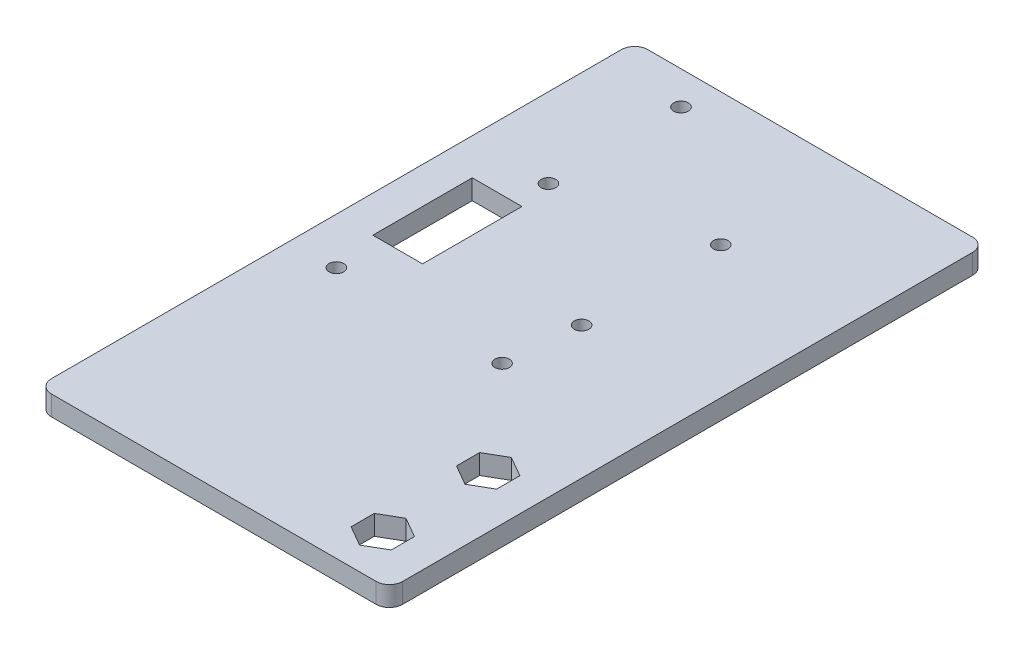
ISO-10303-21;
HEADER;
FILE_DESCRIPTION(('STEP AP214'),'2;1');
FILE_NAME('part.step','',(''),(''),'','','');
FILE_SCHEMA(('AUTOMOTIVE_DESIGN { 1 0 10303 214 1 1 1 1 }'));
ENDSEC;
DATA;
#1=APPLICATION_CONTEXT('core data for automotive mechanical design processes');
#2=APPLICATION_PROTOCOL_DEFINITION('international standard','automotive_design',2000,#1);
#3=PRODUCT_CONTEXT('',#1,'mechanical');
#4=PRODUCT('Part','Part','',(#3));
#5=PRODUCT_RELATED_PRODUCT_CATEGORY('part','',(#4));
#6=PRODUCT_DEFINITION_FORMATION('','',#4);
#7=PRODUCT_DEFINITION_CONTEXT('part definition',#1,'design');
#8=PRODUCT_DEFINITION('design','',#6,#7);
#9=PRODUCT_DEFINITION_SHAPE('','',#8);
#10=(LENGTH_UNIT() NAMED_UNIT(*) SI_UNIT(.MILLI.,.METRE.));
#11=(NAMED_UNIT(*) PLANE_ANGLE_UNIT() SI_UNIT($,.RADIAN.));
#12=(NAMED_UNIT(*) SI_UNIT($,.STERADIAN.) SOLID_ANGLE_UNIT());
#13=UNCERTAINTY_MEASURE_WITH_UNIT(LENGTH_MEASURE(1.E-05),#10,'distance_accuracy_value','');
#14=(GEOMETRIC_REPRESENTATION_CONTEXT(3) GLOBAL_UNCERTAINTY_ASSIGNED_CONTEXT((#13)) GLOBAL_UNIT_ASSIGNED_CONTEXT((#10,
#11,#12)) REPRESENTATION_CONTEXT('',''));
#15=CARTESIAN_POINT('',(0.,0.,0.));
#16=DIRECTION('',(0.,0.,1.));
#17=DIRECTION('',(1.,0.,0.));
#18=AXIS2_PLACEMENT_3D('',#15,#16,#17);
#19=CARTESIAN_POINT('',(51.,3.,-88.));
#20=DIRECTION('',(0.,-1.,0.));
#21=DIRECTION('',(0.,0.,-1.));
#22=AXIS2_PLACEMENT_3D('',#19,#20,#21);
#23=CYLINDRICAL_SURFACE('',#22,2.);
#24=CARTESIAN_POINT('',(51.,0.,-88.));
#25=DIRECTION('',(0.,1.,0.));
#26=DIRECTION('',(0.,0.,-1.));
#27=AXIS2_PLACEMENT_3D('',#24,#25,#26);
#28=CIRCLE('',#27,2.);
#29=CARTESIAN_POINT('',(53.,0.,-88.));
#30=VERTEX_POINT('',#29);
#31=CARTESIAN_POINT('',(51.,0.,-90.));
#32=VERTEX_POINT('',#31);
#33=EDGE_CURVE('E314',#30,#32,#28,.T.);
#34=ORIENTED_EDGE('',*,*,#33,.T.);
#35=DIRECTION('',(0.,-1.,0.));
#36=VECTOR('',#35,1.);
#37=CARTESIAN_POINT('',(51.,3.,-90.));
#38=LINE('',#37,#36);
#39=CARTESIAN_POINT('',(51.,3.,-90.));
#40=VERTEX_POINT('',#39);
#41=EDGE_CURVE('E11',#40,#32,#38,.T.);
#42=ORIENTED_EDGE('',*,*,#41,.F.);
#43=CARTESIAN_POINT('',(51.,3.,-88.));
#44=DIRECTION('',(0.,1.,0.));
#45=DIRECTION('',(0.,0.,-1.));
#46=AXIS2_PLACEMENT_3D('',#43,#44,#45);
#47=CIRCLE('',#46,2.);
#48=CARTESIAN_POINT('',(53.,3.,-88.));
#49=VERTEX_POINT('',#48);
#50=EDGE_CURVE('E355',#49,#40,#47,.T.);
#51=ORIENTED_EDGE('',*,*,#50,.F.);
#52=DIRECTION('',(0.,-1.,0.));
#53=VECTOR('',#52,1.);
#54=CARTESIAN_POINT('',(53.,3.,-88.));
#55=LINE('',#54,#53);
#56=EDGE_CURVE('E373',#49,#30,#55,.T.);
#57=ORIENTED_EDGE('',*,*,#56,.T.);
#58=EDGE_LOOP('',(#34,#42,#51,#57));
#59=FACE_BOUND('',#58,.T.);
#60=ADVANCED_FACE('F33',(#59),#23,.T.);
#61=CARTESIAN_POINT('',(2.,3.,-90.));
#62=DIRECTION('',(0.,0.,1.));
#63=DIRECTION('',(1.,0.,0.));
#64=AXIS2_PLACEMENT_3D('',#61,#62,#63);
#65=PLANE('',#64);
#66=DIRECTION('',(-1.,0.,0.));
#67=VECTOR('',#66,1.);
#68=CARTESIAN_POINT('',(2.,0.,-90.));
#69=LINE('',#68,#67);
#70=CARTESIAN_POINT('',(2.,0.,-90.));
#71=VERTEX_POINT('',#70);
#72=EDGE_CURVE('E376',#32,#71,#69,.T.);
#73=ORIENTED_EDGE('',*,*,#72,.T.);
#74=DIRECTION('',(0.,-1.,0.));
#75=VECTOR('',#74,1.);
#76=CARTESIAN_POINT('',(2.,3.,-90.));
#77=LINE('',#76,#75);
#78=CARTESIAN_POINT('',(2.,3.,-90.));
#79=VERTEX_POINT('',#78);
#80=EDGE_CURVE('E40',#79,#71,#77,.T.);
#81=ORIENTED_EDGE('',*,*,#80,.F.);
#82=DIRECTION('',(-1.,0.,0.));
#83=VECTOR('',#82,1.);
#84=CARTESIAN_POINT('',(2.,3.,-90.));
#85=LINE('',#84,#83);
#86=EDGE_CURVE('E358',#40,#79,#85,.T.);
#87=ORIENTED_EDGE('',*,*,#86,.F.);
#88=ORIENTED_EDGE('',*,*,#41,.T.);
#89=EDGE_LOOP('',(#73,#81,#87,#88));
#90=FACE_BOUND('',#89,.T.);
#91=ADVANCED_FACE('F432',(#90),#65,.F.);
#92=CARTESIAN_POINT('',(2.,3.,-88.));
#93=DIRECTION('',(0.,-1.,0.));
#94=DIRECTION('',(0.,0.,-1.));
#95=AXIS2_PLACEMENT_3D('',#92,#93,#94);
#96=CYLINDRICAL_SURFACE('',#95,2.);
#97=CARTESIAN_POINT('',(2.,0.,-88.));
#98=DIRECTION('',(0.,1.,0.));
#99=DIRECTION('',(0.,0.,1.));
#100=AXIS2_PLACEMENT_3D('',#97,#98,#99);
#101=CIRCLE('',#100,2.);
#102=CARTESIAN_POINT('',(0.,0.,-88.));
#103=VERTEX_POINT('',#102);
#104=EDGE_CURVE('E378',#71,#103,#101,.T.);
#105=ORIENTED_EDGE('',*,*,#104,.T.);
#106=DIRECTION('',(0.,-1.,0.));
#107=VECTOR('',#106,1.);
#108=CARTESIAN_POINT('',(0.,3.,-88.));
#109=LINE('',#108,#107);
#110=CARTESIAN_POINT('',(0.,3.,-88.));
#111=VERTEX_POINT('',#110);
#112=EDGE_CURVE('E403',#111,#103,#109,.T.);
#113=ORIENTED_EDGE('',*,*,#112,.F.);
#114=CARTESIAN_POINT('',(2.,3.,-88.));
#115=DIRECTION('',(0.,1.,0.));
#116=DIRECTION('',(0.,0.,1.));
#117=AXIS2_PLACEMENT_3D('',#114,#115,#116);
#118=CIRCLE('',#117,2.);
#119=EDGE_CURVE('E361',#79,#111,#118,.T.);
#120=ORIENTED_EDGE('',*,*,#119,.F.);
#121=ORIENTED_EDGE('',*,*,#80,.T.);
#122=EDGE_LOOP('',(#105,#113,#120,#121));
#123=FACE_BOUND('',#122,.T.);
#124=ADVANCED_FACE('F410',(#123),#96,.T.);
#125=CARTESIAN_POINT('',(0.,3.,-88.));
#126=DIRECTION('',(1.,0.,0.));
#127=DIRECTION('',(0.,0.,-1.));
#128=AXIS2_PLACEMENT_3D('',#125,#126,#127);
#129=PLANE('',#128);
#130=DIRECTION('',(0.,0.,1.));
#131=VECTOR('',#130,1.);
#132=CARTESIAN_POINT('',(0.,0.,-88.));
#133=LINE('',#132,#131);
#134=CARTESIAN_POINT('',(0.,0.,-2.));
#135=VERTEX_POINT('',#134);
#136=EDGE_CURVE('E380',#103,#135,#133,.T.);
#137=ORIENTED_EDGE('',*,*,#136,.T.);
#138=DIRECTION('',(0.,-1.,0.));
#139=VECTOR('',#138,1.);
#140=CARTESIAN_POINT('',(0.,3.,-2.));
#141=LINE('',#140,#139);
#142=CARTESIAN_POINT('',(0.,3.,-2.));
#143=VERTEX_POINT('',#142);
#144=EDGE_CURVE('E400',#143,#135,#141,.T.);
#145=ORIENTED_EDGE('',*,*,#144,.F.);
#146=DIRECTION('',(0.,0.,1.));
#147=VECTOR('',#146,1.);
#148=CARTESIAN_POINT('',(0.,3.,-88.));
#149=LINE('',#148,#147);
#150=EDGE_CURVE('E363',#111,#143,#149,.T.);
#151=ORIENTED_EDGE('',*,*,#150,.F.);
#152=ORIENTED_EDGE('',*,*,#112,.T.);
#153=EDGE_LOOP('',(#137,#145,#151,#152));
#154=FACE_BOUND('',#153,.T.);
#155=ADVANCED_FACE('F420',(#154),#129,.F.);
#156=CARTESIAN_POINT('',(2.00000000000002,3.,-2.));
#157=DIRECTION('',(0.,-1.,0.));
#158=DIRECTION('',(0.,0.,-1.));
#159=AXIS2_PLACEMENT_3D('',#156,#157,#158);
#160=CYLINDRICAL_SURFACE('',#159,2.);
#161=CARTESIAN_POINT('',(2.00000000000002,0.,-2.));
#162=DIRECTION('',(0.,1.,0.));
#163=DIRECTION('',(0.,0.,1.));
#164=AXIS2_PLACEMENT_3D('',#161,#162,#163);
#165=CIRCLE('',#164,2.);
#166=CARTESIAN_POINT('',(2.00000000000002,0.,0.));
#167=VERTEX_POINT('',#166);
#168=EDGE_CURVE('E382',#135,#167,#165,.T.);
#169=ORIENTED_EDGE('',*,*,#168,.T.);
#170=DIRECTION('',(0.,-1.,0.));
#171=VECTOR('',#170,1.);
#172=CARTESIAN_POINT('',(2.00000000000002,3.,0.));
#173=LINE('',#172,#171);
#174=CARTESIAN_POINT('',(2.00000000000002,3.,0.));
#175=VERTEX_POINT('',#174);
#176=EDGE_CURVE('E397',#175,#167,#173,.T.);
#177=ORIENTED_EDGE('',*,*,#176,.F.);
#178=CARTESIAN_POINT('',(2.00000000000002,3.,-2.));
#179=DIRECTION('',(0.,1.,0.));
#180=DIRECTION('',(0.,0.,1.));
#181=AXIS2_PLACEMENT_3D('',#178,#179,#180);
#182=CIRCLE('',#181,2.);
#183=EDGE_CURVE('E365',#143,#175,#182,.T.);
#184=ORIENTED_EDGE('',*,*,#183,.F.);
#185=ORIENTED_EDGE('',*,*,#144,.T.);
#186=EDGE_LOOP('',(#169,#177,#184,#185));
#187=FACE_BOUND('',#186,.T.);
#188=ADVANCED_FACE('F424',(#187),#160,.T.);
#189=CARTESIAN_POINT('',(2.00000000000002,3.,0.));
#190=DIRECTION('',(0.,0.,-1.));
#191=DIRECTION('',(-1.,0.,0.));
#192=AXIS2_PLACEMENT_3D('',#189,#190,#191);
#193=PLANE('',#192);
#194=DIRECTION('',(1.,0.,0.));
#195=VECTOR('',#194,1.);
#196=CARTESIAN_POINT('',(2.00000000000002,0.,0.));
#197=LINE('',#196,#195);
#198=CARTESIAN_POINT('',(51.,0.,0.));
#199=VERTEX_POINT('',#198);
#200=EDGE_CURVE('E384',#167,#199,#197,.T.);
#201=ORIENTED_EDGE('',*,*,#200,.T.);
#202=DIRECTION('',(0.,-1.,0.));
#203=VECTOR('',#202,1.);
#204=CARTESIAN_POINT('',(51.,3.,0.));
#205=LINE('',#204,#203);
#206=CARTESIAN_POINT('',(51.,3.,0.));
#207=VERTEX_POINT('',#206);
#208=EDGE_CURVE('E394',#207,#199,#205,.T.);
#209=ORIENTED_EDGE('',*,*,#208,.F.);
#210=DIRECTION('',(1.,0.,0.));
#211=VECTOR('',#210,1.);
#212=CARTESIAN_POINT('',(2.00000000000002,3.,0.));
#213=LINE('',#212,#211);
#214=EDGE_CURVE('E367',#175,#207,#213,.T.);
#215=ORIENTED_EDGE('',*,*,#214,.F.);
#216=ORIENTED_EDGE('',*,*,#176,.T.);
#217=EDGE_LOOP('',(#201,#209,#215,#216));
#218=FACE_BOUND('',#217,.T.);
#219=ADVANCED_FACE('F445',(#218),#193,.F.);
#220=CARTESIAN_POINT('',(51.,3.,-2.));
#221=DIRECTION('',(0.,-1.,0.));
#222=DIRECTION('',(0.,0.,-1.));
#223=AXIS2_PLACEMENT_3D('',#220,#221,#222);
#224=CYLINDRICAL_SURFACE('',#223,2.);
#225=CARTESIAN_POINT('',(51.,0.,-2.));
#226=DIRECTION('',(0.,1.,0.));
#227=DIRECTION('',(0.,0.,1.));
#228=AXIS2_PLACEMENT_3D('',#225,#226,#227);
#229=CIRCLE('',#228,2.);
#230=CARTESIAN_POINT('',(53.,0.,-2.));
#231=VERTEX_POINT('',#230);
#232=EDGE_CURVE('E386',#199,#231,#229,.T.);
#233=ORIENTED_EDGE('',*,*,#232,.T.);
#234=DIRECTION('',(0.,-1.,0.));
#235=VECTOR('',#234,1.);
#236=CARTESIAN_POINT('',(53.,3.,-2.));
#237=LINE('',#236,#235);
#238=CARTESIAN_POINT('',(53.,3.,-2.));
#239=VERTEX_POINT('',#238);
#240=EDGE_CURVE('E391',#239,#231,#237,.T.);
#241=ORIENTED_EDGE('',*,*,#240,.F.);
#242=CARTESIAN_POINT('',(51.,3.,-2.));
#243=DIRECTION('',(0.,1.,0.));
#244=DIRECTION('',(0.,0.,1.));
#245=AXIS2_PLACEMENT_3D('',#242,#243,#244);
#246=CIRCLE('',#245,2.);
#247=EDGE_CURVE('E369',#207,#239,#246,.T.);
#248=ORIENTED_EDGE('',*,*,#247,.F.);
#249=ORIENTED_EDGE('',*,*,#208,.T.);
#250=EDGE_LOOP('',(#233,#241,#248,#249));
#251=FACE_BOUND('',#250,.T.);
#252=ADVANCED_FACE('F443',(#251),#224,.T.);
#253=CARTESIAN_POINT('',(53.,3.,-88.));
#254=DIRECTION('',(-1.,0.,0.));
#255=DIRECTION('',(0.,0.,1.));
#256=AXIS2_PLACEMENT_3D('',#253,#254,#255);
#257=PLANE('',#256);
#258=DIRECTION('',(0.,0.,-1.));
#259=VECTOR('',#258,1.);
#260=CARTESIAN_POINT('',(53.,0.,-88.));
#261=LINE('',#260,#259);
#262=EDGE_CURVE('E359',#231,#30,#261,.T.);
#263=ORIENTED_EDGE('',*,*,#262,.T.);
#264=ORIENTED_EDGE('',*,*,#56,.F.);
#265=DIRECTION('',(0.,0.,-1.));
#266=VECTOR('',#265,1.);
#267=CARTESIAN_POINT('',(53.,3.,-88.));
#268=LINE('',#267,#266);
#269=EDGE_CURVE('E371',#239,#49,#268,.T.);
#270=ORIENTED_EDGE('',*,*,#269,.F.);
#271=ORIENTED_EDGE('',*,*,#240,.T.);
#272=EDGE_LOOP('',(#263,#264,#270,#271));
#273=FACE_BOUND('',#272,.T.);
#274=ADVANCED_FACE('F438',(#273),#257,.F.);
#275=CARTESIAN_POINT('',(51.,3.,-88.));
#276=DIRECTION('',(0.,-1.,0.));
#277=DIRECTION('',(0.,0.,-1.));
#278=AXIS2_PLACEMENT_3D('',#275,#276,#277);
#279=PLANE('',#278);
#280=CARTESIAN_POINT('',(7.,3.,-38.));
#281=DIRECTION('',(0.,1.,0.));
#282=DIRECTION('',(0.,0.,1.));
#283=AXIS2_PLACEMENT_3D('',#280,#281,#282);
#284=CIRCLE('',#283,1.1);
#285=CARTESIAN_POINT('',(7.,3.,-36.9));
#286=VERTEX_POINT('',#285);
#287=EDGE_CURVE('E732',#286,#286,#284,.T.);
#288=ORIENTED_EDGE('',*,*,#287,.F.);
#289=EDGE_LOOP('',(#288));
#290=FACE_BOUND('',#289,.T.);
#291=CARTESIAN_POINT('',(32.,3.,-38.));
#292=DIRECTION('',(0.,1.,0.));
#293=DIRECTION('',(0.,0.,1.));
#294=AXIS2_PLACEMENT_3D('',#291,#292,#293);
#295=CIRCLE('',#294,1.1);
#296=CARTESIAN_POINT('',(32.,3.,-36.9));
#297=VERTEX_POINT('',#296);
#298=EDGE_CURVE('E221',#297,#297,#295,.T.);
#299=ORIENTED_EDGE('',*,*,#298,.F.);
#300=EDGE_LOOP('',(#299));
#301=FACE_BOUND('',#300,.T.);
#302=DIRECTION('',(0.,0.,1.));
#303=VECTOR('',#302,1.);
#304=CARTESIAN_POINT('',(41.968911086742,3.,-8.74999999999999));
#305=LINE('',#304,#303);
#306=CARTESIAN_POINT('',(41.968911086742,3.,-8.74999999999999));
#307=VERTEX_POINT('',#306);
#308=CARTESIAN_POINT('',(41.968911086742,3.,-5.25));
#309=VERTEX_POINT('',#308);
#310=EDGE_CURVE('E232',#307,#309,#305,.T.);
#311=ORIENTED_EDGE('',*,*,#310,.F.);
#312=DIRECTION('',(-0.866025403784438,0.,0.500000000000001));
#313=VECTOR('',#312,1.);
#314=CARTESIAN_POINT('',(44.9999999999875,3.,-10.5));
#315=LINE('',#314,#313);
#316=CARTESIAN_POINT('',(44.9999999999875,3.,-10.5));
#317=VERTEX_POINT('',#316);
#318=EDGE_CURVE('E47',#317,#307,#315,.T.);
#319=ORIENTED_EDGE('',*,*,#318,.F.);
#320=DIRECTION('',(-0.866025403784438,0.,-0.500000000000001));
#321=VECTOR('',#320,1.);
#322=CARTESIAN_POINT('',(48.031088913233,3.,-8.75));
#323=LINE('',#322,#321);
#324=CARTESIAN_POINT('',(48.031088913233,3.,-8.75));
#325=VERTEX_POINT('',#324);
#326=EDGE_CURVE('E215',#325,#317,#323,.T.);
#327=ORIENTED_EDGE('',*,*,#326,.F.);
#328=DIRECTION('',(0.,0.,-1.));
#329=VECTOR('',#328,1.);
#330=CARTESIAN_POINT('',(48.031088913233,3.,-5.25));
#331=LINE('',#330,#329);
#332=CARTESIAN_POINT('',(48.031088913233,3.,-5.25));
#333=VERTEX_POINT('',#332);
#334=EDGE_CURVE('E218',#333,#325,#331,.T.);
#335=ORIENTED_EDGE('',*,*,#334,.F.);
#336=DIRECTION('',(0.866025403784438,0.,-0.500000000000001));
#337=VECTOR('',#336,1.);
#338=CARTESIAN_POINT('',(44.9999999999875,3.,-3.5));
#339=LINE('',#338,#337);
#340=CARTESIAN_POINT('',(44.9999999999875,3.,-3.5));
#341=VERTEX_POINT('',#340);
#342=EDGE_CURVE('E238',#341,#333,#339,.T.);
#343=ORIENTED_EDGE('',*,*,#342,.F.);
#344=DIRECTION('',(0.866025403784439,0.,0.499999999999999));
#345=VECTOR('',#344,1.);
#346=CARTESIAN_POINT('',(41.968911086742,3.,-5.25));
#347=LINE('',#346,#345);
#348=EDGE_CURVE('E235',#309,#341,#347,.T.);
#349=ORIENTED_EDGE('',*,*,#348,.F.);
#350=EDGE_LOOP('',(#311,#319,#327,#335,#343,#349));
#351=FACE_BOUND('',#350,.T.);
#352=CARTESIAN_POINT('',(33.,3.,-49.));
#353=DIRECTION('',(0.,1.,0.));
#354=DIRECTION('',(0.,0.,1.));
#355=AXIS2_PLACEMENT_3D('',#352,#353,#354);
#356=CIRCLE('',#355,1.1);
#357=CARTESIAN_POINT('',(33.,3.,-47.9));
#358=VERTEX_POINT('',#357);
#359=EDGE_CURVE('E257',#358,#358,#356,.T.);
#360=ORIENTED_EDGE('',*,*,#359,.F.);
#361=EDGE_LOOP('',(#360));
#362=FACE_BOUND('',#361,.T.);
#363=CARTESIAN_POINT('',(33.,3.,-70.));
#364=DIRECTION('',(0.,1.,0.));
#365=DIRECTION('',(0.,0.,1.));
#366=AXIS2_PLACEMENT_3D('',#363,#364,#365);
#367=CIRCLE('',#366,1.1);
#368=CARTESIAN_POINT('',(33.,3.,-68.9));
#369=VERTEX_POINT('',#368);
#370=EDGE_CURVE('E256',#369,#369,#367,.T.);
#371=ORIENTED_EDGE('',*,*,#370,.F.);
#372=EDGE_LOOP('',(#371));
#373=FACE_BOUND('',#372,.T.);
#374=DIRECTION('',(0.,0.,1.));
#375=VECTOR('',#374,1.);
#376=CARTESIAN_POINT('',(41.968911086742,3.,-24.6529145755533));
#377=LINE('',#376,#375);
#378=CARTESIAN_POINT('',(41.968911086742,3.,-24.6529145755533));
#379=VERTEX_POINT('',#378);
#380=CARTESIAN_POINT('',(41.968911086742,3.,-21.1529145755533));
#381=VERTEX_POINT('',#380);
#382=EDGE_CURVE('E282',#379,#381,#377,.T.);
#383=ORIENTED_EDGE('',*,*,#382,.F.);
#384=DIRECTION('',(-0.866025403784438,0.,0.5));
#385=VECTOR('',#384,1.);
#386=CARTESIAN_POINT('',(44.9999999999875,3.,-26.4029145755533));
#387=LINE('',#386,#385);
#388=CARTESIAN_POINT('',(44.9999999999875,3.,-26.4029145755533));
#389=VERTEX_POINT('',#388);
#390=EDGE_CURVE('E55',#389,#379,#387,.T.);
#391=ORIENTED_EDGE('',*,*,#390,.F.);
#392=DIRECTION('',(-0.866025403784438,0.,-0.500000000000001));
#393=VECTOR('',#392,1.);
#394=CARTESIAN_POINT('',(48.031088913233,3.,-24.6529145755533));
#395=LINE('',#394,#393);
#396=CARTESIAN_POINT('',(48.031088913233,3.,-24.6529145755533));
#397=VERTEX_POINT('',#396);
#398=EDGE_CURVE('E265',#397,#389,#395,.T.);
#399=ORIENTED_EDGE('',*,*,#398,.F.);
#400=DIRECTION('',(0.,0.,-1.));
#401=VECTOR('',#400,1.);
#402=CARTESIAN_POINT('',(48.031088913233,3.,-21.1529145755533));
#403=LINE('',#402,#401);
#404=CARTESIAN_POINT('',(48.031088913233,3.,-21.1529145755533));
#405=VERTEX_POINT('',#404);
#406=EDGE_CURVE('E292',#405,#397,#403,.T.);
#407=ORIENTED_EDGE('',*,*,#406,.F.);
#408=DIRECTION('',(0.866025403784438,0.,-0.5));
#409=VECTOR('',#408,1.);
#410=CARTESIAN_POINT('',(44.9999999999875,3.,-19.4029145755533));
#411=LINE('',#410,#409);
#412=CARTESIAN_POINT('',(44.9999999999875,3.,-19.4029145755533));
#413=VERTEX_POINT('',#412);
#414=EDGE_CURVE('E289',#413,#405,#411,.T.);
#415=ORIENTED_EDGE('',*,*,#414,.F.);
#416=DIRECTION('',(0.866025403784438,0.,0.5));
#417=VECTOR('',#416,1.);
#418=CARTESIAN_POINT('',(41.968911086742,3.,-21.1529145755533));
#419=LINE('',#418,#417);
#420=EDGE_CURVE('E286',#381,#413,#419,.T.);
#421=ORIENTED_EDGE('',*,*,#420,.F.);
#422=EDGE_LOOP('',(#383,#391,#399,#407,#415,#421));
#423=FACE_BOUND('',#422,.T.);
#424=CARTESIAN_POINT('',(12.,3.,-85.));
#425=DIRECTION('',(0.,1.,0.));
#426=DIRECTION('',(0.,0.,1.));
#427=AXIS2_PLACEMENT_3D('',#424,#425,#426);
#428=CIRCLE('',#427,1.1);
#429=CARTESIAN_POINT('',(12.,3.,-83.9));
#430=VERTEX_POINT('',#429);
#431=EDGE_CURVE('E315',#430,#430,#428,.T.);
#432=ORIENTED_EDGE('',*,*,#431,.F.);
#433=EDGE_LOOP('',(#432));
#434=FACE_BOUND('',#433,.T.);
#435=CARTESIAN_POINT('',(12.,3.,-65.));
#436=DIRECTION('',(0.,1.,0.));
#437=DIRECTION('',(0.,0.,1.));
#438=AXIS2_PLACEMENT_3D('',#435,#436,#437);
#439=CIRCLE('',#438,1.1);
#440=CARTESIAN_POINT('',(12.,3.,-63.9));
#441=VERTEX_POINT('',#440);
#442=EDGE_CURVE('E321',#441,#441,#439,.T.);
#443=ORIENTED_EDGE('',*,*,#442,.F.);
#444=EDGE_LOOP('',(#443));
#445=FACE_BOUND('',#444,.T.);
#446=DIRECTION('',(1.,0.,0.));
#447=VECTOR('',#446,1.);
#448=CARTESIAN_POINT('',(5.50000000000001,3.,-45.));
#449=LINE('',#448,#447);
#450=CARTESIAN_POINT('',(5.50000000000001,3.,-45.));
#451=VERTEX_POINT('',#450);
#452=CARTESIAN_POINT('',(13.,3.,-45.));
#453=VERTEX_POINT('',#452);
#454=EDGE_CURVE('E340',#451,#453,#449,.T.);
#455=ORIENTED_EDGE('',*,*,#454,.F.);
#456=DIRECTION('',(0.,0.,1.));
#457=VECTOR('',#456,1.);
#458=CARTESIAN_POINT('',(5.50000000000001,3.,-60.));
#459=LINE('',#458,#457);
#460=CARTESIAN_POINT('',(5.50000000000001,3.,-60.));
#461=VERTEX_POINT('',#460);
#462=EDGE_CURVE('E245',#461,#451,#459,.T.);
#463=ORIENTED_EDGE('',*,*,#462,.F.);
#464=DIRECTION('',(-1.,0.,0.));
#465=VECTOR('',#464,1.);
#466=CARTESIAN_POINT('',(5.50000000000001,3.,-60.));
#467=LINE('',#466,#465);
#468=CARTESIAN_POINT('',(13.,3.,-60.));
#469=VERTEX_POINT('',#468);
#470=EDGE_CURVE('E329',#469,#461,#467,.T.);
#471=ORIENTED_EDGE('',*,*,#470,.F.);
#472=DIRECTION('',(0.,0.,-1.));
#473=VECTOR('',#472,1.);
#474=CARTESIAN_POINT('',(13.,3.,-60.));
#475=LINE('',#474,#473);
#476=EDGE_CURVE('E343',#453,#469,#475,.T.);
#477=ORIENTED_EDGE('',*,*,#476,.F.);
#478=EDGE_LOOP('',(#455,#463,#471,#477));
#479=FACE_BOUND('',#478,.T.);
#480=ORIENTED_EDGE('',*,*,#50,.T.);
#481=ORIENTED_EDGE('',*,*,#86,.T.);
#482=ORIENTED_EDGE('',*,*,#119,.T.);
#483=ORIENTED_EDGE('',*,*,#150,.T.);
#484=ORIENTED_EDGE('',*,*,#183,.T.);
#485=ORIENTED_EDGE('',*,*,#214,.T.);
#486=ORIENTED_EDGE('',*,*,#247,.T.);
#487=ORIENTED_EDGE('',*,*,#269,.T.);
#488=EDGE_LOOP('',(#480,#481,#482,#483,#484,#485,#486,#487));
#489=FACE_BOUND('',#488,.T.);
#490=ADVANCED_FACE('F428',(#290,#301,#351,#362,#373,#423,#434,#445,#479,#489),#279,.F.);
#491=CARTESIAN_POINT('',(51.,0.,-88.));
#492=DIRECTION('',(0.,-1.,0.));
#493=DIRECTION('',(0.,0.,-1.));
#494=AXIS2_PLACEMENT_3D('',#491,#492,#493);
#495=PLANE('',#494);
#496=CARTESIAN_POINT('',(7.,0.,-38.));
#497=DIRECTION('',(0.,1.,0.));
#498=DIRECTION('',(0.,0.,1.));
#499=AXIS2_PLACEMENT_3D('',#496,#497,#498);
#500=CIRCLE('',#499,1.1);
#501=CARTESIAN_POINT('',(7.,0.,-36.9));
#502=VERTEX_POINT('',#501);
#503=EDGE_CURVE('E260',#502,#502,#500,.T.);
#504=ORIENTED_EDGE('',*,*,#503,.T.);
#505=EDGE_LOOP('',(#504));
#506=FACE_BOUND('',#505,.T.);
#507=CARTESIAN_POINT('',(32.,0.,-38.));
#508=DIRECTION('',(0.,1.,0.));
#509=DIRECTION('',(0.,0.,1.));
#510=AXIS2_PLACEMENT_3D('',#507,#508,#509);
#511=CIRCLE('',#510,1.1);
#512=CARTESIAN_POINT('',(32.,0.,-36.9));
#513=VERTEX_POINT('',#512);
#514=EDGE_CURVE('E733',#513,#513,#511,.T.);
#515=ORIENTED_EDGE('',*,*,#514,.T.);
#516=EDGE_LOOP('',(#515));
#517=FACE_BOUND('',#516,.T.);
#518=DIRECTION('',(-0.866025403784438,0.,0.500000000000001));
#519=VECTOR('',#518,1.);
#520=CARTESIAN_POINT('',(44.9999999999875,0.,-10.5));
#521=LINE('',#520,#519);
#522=CARTESIAN_POINT('',(44.9999999999875,0.,-10.5));
#523=VERTEX_POINT('',#522);
#524=CARTESIAN_POINT('',(41.968911086742,0.,-8.74999999999999));
#525=VERTEX_POINT('',#524);
#526=EDGE_CURVE('E195',#523,#525,#521,.T.);
#527=ORIENTED_EDGE('',*,*,#526,.T.);
#528=DIRECTION('',(0.,0.,1.));
#529=VECTOR('',#528,1.);
#530=CARTESIAN_POINT('',(41.968911086742,0.,-8.74999999999999));
#531=LINE('',#530,#529);
#532=CARTESIAN_POINT('',(41.968911086742,0.,-5.25));
#533=VERTEX_POINT('',#532);
#534=EDGE_CURVE('E205',#525,#533,#531,.T.);
#535=ORIENTED_EDGE('',*,*,#534,.T.);
#536=DIRECTION('',(0.866025403784439,0.,0.499999999999999));
#537=VECTOR('',#536,1.);
#538=CARTESIAN_POINT('',(41.968911086742,0.,-5.25));
#539=LINE('',#538,#537);
#540=CARTESIAN_POINT('',(44.9999999999875,0.,-3.5));
#541=VERTEX_POINT('',#540);
#542=EDGE_CURVE('E209',#533,#541,#539,.T.);
#543=ORIENTED_EDGE('',*,*,#542,.T.);
#544=DIRECTION('',(0.866025403784438,0.,-0.500000000000001));
#545=VECTOR('',#544,1.);
#546=CARTESIAN_POINT('',(44.9999999999875,0.,-3.5));
#547=LINE('',#546,#545);
#548=CARTESIAN_POINT('',(48.031088913233,0.,-5.25));
#549=VERTEX_POINT('',#548);
#550=EDGE_CURVE('E225',#541,#549,#547,.T.);
#551=ORIENTED_EDGE('',*,*,#550,.T.);
#552=DIRECTION('',(0.,0.,-1.));
#553=VECTOR('',#552,1.);
#554=CARTESIAN_POINT('',(48.031088913233,0.,-5.25));
#555=LINE('',#554,#553);
#556=CARTESIAN_POINT('',(48.031088913233,0.,-8.75));
#557=VERTEX_POINT('',#556);
#558=EDGE_CURVE('E228',#549,#557,#555,.T.);
#559=ORIENTED_EDGE('',*,*,#558,.T.);
#560=DIRECTION('',(-0.866025403784438,0.,-0.500000000000001));
#561=VECTOR('',#560,1.);
#562=CARTESIAN_POINT('',(48.031088913233,0.,-8.75));
#563=LINE('',#562,#561);
#564=EDGE_CURVE('E201',#557,#523,#563,.T.);
#565=ORIENTED_EDGE('',*,*,#564,.T.);
#566=EDGE_LOOP('',(#527,#535,#543,#551,#559,#565));
#567=FACE_BOUND('',#566,.T.);
#568=CARTESIAN_POINT('',(33.,0.,-49.));
#569=DIRECTION('',(0.,1.,0.));
#570=DIRECTION('',(0.,0.,1.));
#571=AXIS2_PLACEMENT_3D('',#568,#569,#570);
#572=CIRCLE('',#571,1.1);
#573=CARTESIAN_POINT('',(33.,0.,-47.9));
#574=VERTEX_POINT('',#573);
#575=EDGE_CURVE('E253',#574,#574,#572,.T.);
#576=ORIENTED_EDGE('',*,*,#575,.T.);
#577=EDGE_LOOP('',(#576));
#578=FACE_BOUND('',#577,.T.);
#579=CARTESIAN_POINT('',(33.,0.,-70.));
#580=DIRECTION('',(0.,1.,0.));
#581=DIRECTION('',(0.,0.,1.));
#582=AXIS2_PLACEMENT_3D('',#579,#580,#581);
#583=CIRCLE('',#582,1.1);
#584=CARTESIAN_POINT('',(33.,0.,-68.9));
#585=VERTEX_POINT('',#584);
#586=EDGE_CURVE('E283',#585,#585,#583,.T.);
#587=ORIENTED_EDGE('',*,*,#586,.T.);
#588=EDGE_LOOP('',(#587));
#589=FACE_BOUND('',#588,.T.);
#590=DIRECTION('',(-0.866025403784438,0.,0.5));
#591=VECTOR('',#590,1.);
#592=CARTESIAN_POINT('',(44.9999999999875,0.,-26.4029145755533));
#593=LINE('',#592,#591);
#594=CARTESIAN_POINT('',(44.9999999999875,0.,-26.4029145755533));
#595=VERTEX_POINT('',#594);
#596=CARTESIAN_POINT('',(41.968911086742,0.,-24.6529145755533));
#597=VERTEX_POINT('',#596);
#598=EDGE_CURVE('E261',#595,#597,#593,.T.);
#599=ORIENTED_EDGE('',*,*,#598,.T.);
#600=DIRECTION('',(0.,0.,1.));
#601=VECTOR('',#600,1.);
#602=CARTESIAN_POINT('',(41.968911086742,0.,-24.6529145755533));
#603=LINE('',#602,#601);
#604=CARTESIAN_POINT('',(41.968911086742,0.,-21.1529145755533));
#605=VERTEX_POINT('',#604);
#606=EDGE_CURVE('E264',#597,#605,#603,.T.);
#607=ORIENTED_EDGE('',*,*,#606,.T.);
#608=DIRECTION('',(0.866025403784438,0.,0.5));
#609=VECTOR('',#608,1.);
#610=CARTESIAN_POINT('',(41.968911086742,0.,-21.1529145755533));
#611=LINE('',#610,#609);
#612=CARTESIAN_POINT('',(44.9999999999875,0.,-19.4029145755533));
#613=VERTEX_POINT('',#612);
#614=EDGE_CURVE('E268',#605,#613,#611,.T.);
#615=ORIENTED_EDGE('',*,*,#614,.T.);
#616=DIRECTION('',(0.866025403784438,0.,-0.5));
#617=VECTOR('',#616,1.);
#618=CARTESIAN_POINT('',(44.9999999999875,0.,-19.4029145755533));
#619=LINE('',#618,#617);
#620=CARTESIAN_POINT('',(48.031088913233,0.,-21.1529145755533));
#621=VERTEX_POINT('',#620);
#622=EDGE_CURVE('E271',#613,#621,#619,.T.);
#623=ORIENTED_EDGE('',*,*,#622,.T.);
#624=DIRECTION('',(0.,0.,-1.));
#625=VECTOR('',#624,1.);
#626=CARTESIAN_POINT('',(48.031088913233,0.,-21.1529145755533));
#627=LINE('',#626,#625);
#628=CARTESIAN_POINT('',(48.031088913233,0.,-24.6529145755533));
#629=VERTEX_POINT('',#628);
#630=EDGE_CURVE('E274',#621,#629,#627,.T.);
#631=ORIENTED_EDGE('',*,*,#630,.T.);
#632=DIRECTION('',(-0.866025403784438,0.,-0.500000000000001));
#633=VECTOR('',#632,1.);
#634=CARTESIAN_POINT('',(48.031088913233,0.,-24.6529145755533));
#635=LINE('',#634,#633);
#636=EDGE_CURVE('E277',#629,#595,#635,.T.);
#637=ORIENTED_EDGE('',*,*,#636,.T.);
#638=EDGE_LOOP('',(#599,#607,#615,#623,#631,#637));
#639=FACE_BOUND('',#638,.T.);
#640=CARTESIAN_POINT('',(12.,0.,-85.));
#641=DIRECTION('',(0.,1.,0.));
#642=DIRECTION('',(0.,0.,1.));
#643=AXIS2_PLACEMENT_3D('',#640,#641,#642);
#644=CIRCLE('',#643,1.1);
#645=CARTESIAN_POINT('',(12.,0.,-83.9));
#646=VERTEX_POINT('',#645);
#647=EDGE_CURVE('E311',#646,#646,#644,.T.);
#648=ORIENTED_EDGE('',*,*,#647,.T.);
#649=EDGE_LOOP('',(#648));
#650=FACE_BOUND('',#649,.T.);
#651=CARTESIAN_POINT('',(12.,0.,-65.));
#652=DIRECTION('',(0.,1.,0.));
#653=DIRECTION('',(0.,0.,1.));
#654=AXIS2_PLACEMENT_3D('',#651,#652,#653);
#655=CIRCLE('',#654,1.1);
#656=CARTESIAN_POINT('',(12.,0.,-63.9));
#657=VERTEX_POINT('',#656);
#658=EDGE_CURVE('E318',#657,#657,#655,.T.);
#659=ORIENTED_EDGE('',*,*,#658,.T.);
#660=EDGE_LOOP('',(#659));
#661=FACE_BOUND('',#660,.T.);
#662=DIRECTION('',(0.,0.,1.));
#663=VECTOR('',#662,1.);
#664=CARTESIAN_POINT('',(5.50000000000001,0.,-60.));
#665=LINE('',#664,#663);
#666=CARTESIAN_POINT('',(5.50000000000001,0.,-60.));
#667=VERTEX_POINT('',#666);
#668=CARTESIAN_POINT('',(5.50000000000001,0.,-45.));
#669=VERTEX_POINT('',#668);
#670=EDGE_CURVE('E325',#667,#669,#665,.T.);
#671=ORIENTED_EDGE('',*,*,#670,.T.);
#672=DIRECTION('',(1.,0.,0.));
#673=VECTOR('',#672,1.);
#674=CARTESIAN_POINT('',(5.50000000000001,0.,-45.));
#675=LINE('',#674,#673);
#676=CARTESIAN_POINT('',(13.,0.,-45.));
#677=VERTEX_POINT('',#676);
#678=EDGE_CURVE('E328',#669,#677,#675,.T.);
#679=ORIENTED_EDGE('',*,*,#678,.T.);
#680=DIRECTION('',(0.,0.,-1.));
#681=VECTOR('',#680,1.);
#682=CARTESIAN_POINT('',(13.,0.,-60.));
#683=LINE('',#682,#681);
#684=CARTESIAN_POINT('',(13.,0.,-60.));
#685=VERTEX_POINT('',#684);
#686=EDGE_CURVE('E332',#677,#685,#683,.T.);
#687=ORIENTED_EDGE('',*,*,#686,.T.);
#688=DIRECTION('',(-1.,0.,0.));
#689=VECTOR('',#688,1.);
#690=CARTESIAN_POINT('',(5.50000000000001,0.,-60.));
#691=LINE('',#690,#689);
#692=EDGE_CURVE('E335',#685,#667,#691,.T.);
#693=ORIENTED_EDGE('',*,*,#692,.T.);
#694=EDGE_LOOP('',(#671,#679,#687,#693));
#695=FACE_BOUND('',#694,.T.);
#696=ORIENTED_EDGE('',*,*,#33,.F.);
#697=ORIENTED_EDGE('',*,*,#262,.F.);
#698=ORIENTED_EDGE('',*,*,#232,.F.);
#699=ORIENTED_EDGE('',*,*,#200,.F.);
#700=ORIENTED_EDGE('',*,*,#168,.F.);
#701=ORIENTED_EDGE('',*,*,#136,.F.);
#702=ORIENTED_EDGE('',*,*,#104,.F.);
#703=ORIENTED_EDGE('',*,*,#72,.F.);
#704=EDGE_LOOP('',(#696,#697,#698,#699,#700,#701,#702,#703));
#705=FACE_BOUND('',#704,.T.);
#706=ADVANCED_FACE('F211',(#506,#517,#567,#578,#589,#639,#650,#661,#695,#705),#495,.T.);
#707=CARTESIAN_POINT('',(5.50000000000001,0.,-60.));
#708=DIRECTION('',(-1.,0.,0.));
#709=DIRECTION('',(0.,0.,1.));
#710=AXIS2_PLACEMENT_3D('',#707,#708,#709);
#711=PLANE('',#710);
#712=ORIENTED_EDGE('',*,*,#462,.T.);
#713=DIRECTION('',(0.,1.,0.));
#714=VECTOR('',#713,1.);
#715=CARTESIAN_POINT('',(5.50000000000001,0.,-45.));
#716=LINE('',#715,#714);
#717=EDGE_CURVE('E338',#669,#451,#716,.T.);
#718=ORIENTED_EDGE('',*,*,#717,.F.);
#719=ORIENTED_EDGE('',*,*,#670,.F.);
#720=DIRECTION('',(0.,1.,0.));
#721=VECTOR('',#720,1.);
#722=CARTESIAN_POINT('',(5.50000000000001,0.,-60.));
#723=LINE('',#722,#721);
#724=EDGE_CURVE('E324',#667,#461,#723,.T.);
#725=ORIENTED_EDGE('',*,*,#724,.T.);
#726=EDGE_LOOP('',(#712,#718,#719,#725));
#727=FACE_BOUND('',#726,.T.);
#728=ADVANCED_FACE('F497',(#727),#711,.F.);
#729=CARTESIAN_POINT('',(5.50000000000001,0.,-60.));
#730=DIRECTION('',(0.,0.,-1.));
#731=DIRECTION('',(-1.,0.,0.));
#732=AXIS2_PLACEMENT_3D('',#729,#730,#731);
#733=PLANE('',#732);
#734=ORIENTED_EDGE('',*,*,#470,.T.);
#735=ORIENTED_EDGE('',*,*,#724,.F.);
#736=ORIENTED_EDGE('',*,*,#692,.F.);
#737=DIRECTION('',(0.,1.,0.));
#738=VECTOR('',#737,1.);
#739=CARTESIAN_POINT('',(13.,0.,-60.));
#740=LINE('',#739,#738);
#741=EDGE_CURVE('E349',#685,#469,#740,.T.);
#742=ORIENTED_EDGE('',*,*,#741,.T.);
#743=EDGE_LOOP('',(#734,#735,#736,#742));
#744=FACE_BOUND('',#743,.T.);
#745=ADVANCED_FACE('F502',(#744),#733,.F.);
#746=CARTESIAN_POINT('',(13.,0.,-60.));
#747=DIRECTION('',(1.,0.,0.));
#748=DIRECTION('',(0.,0.,-1.));
#749=AXIS2_PLACEMENT_3D('',#746,#747,#748);
#750=PLANE('',#749);
#751=ORIENTED_EDGE('',*,*,#476,.T.);
#752=ORIENTED_EDGE('',*,*,#741,.F.);
#753=ORIENTED_EDGE('',*,*,#686,.F.);
#754=DIRECTION('',(0.,1.,0.));
#755=VECTOR('',#754,1.);
#756=CARTESIAN_POINT('',(13.,0.,-45.));
#757=LINE('',#756,#755);
#758=EDGE_CURVE('E351',#677,#453,#757,.T.);
#759=ORIENTED_EDGE('',*,*,#758,.T.);
#760=EDGE_LOOP('',(#751,#752,#753,#759));
#761=FACE_BOUND('',#760,.T.);
#762=ADVANCED_FACE('F514',(#761),#750,.F.);
#763=CARTESIAN_POINT('',(5.50000000000001,0.,-45.));
#764=DIRECTION('',(0.,0.,1.));
#765=DIRECTION('',(1.,0.,0.));
#766=AXIS2_PLACEMENT_3D('',#763,#764,#765);
#767=PLANE('',#766);
#768=ORIENTED_EDGE('',*,*,#454,.T.);
#769=ORIENTED_EDGE('',*,*,#758,.F.);
#770=ORIENTED_EDGE('',*,*,#678,.F.);
#771=ORIENTED_EDGE('',*,*,#717,.T.);
#772=EDGE_LOOP('',(#768,#769,#770,#771));
#773=FACE_BOUND('',#772,.T.);
#774=ADVANCED_FACE('F524',(#773),#767,.F.);
#775=CARTESIAN_POINT('',(12.,0.,-65.));
#776=DIRECTION('',(0.,1.,0.));
#777=DIRECTION('',(0.,0.,1.));
#778=AXIS2_PLACEMENT_3D('',#775,#776,#777);
#779=CYLINDRICAL_SURFACE('',#778,1.1);
#780=ORIENTED_EDGE('',*,*,#658,.F.);
#781=EDGE_LOOP('',(#780));
#782=FACE_BOUND('',#781,.T.);
#783=ORIENTED_EDGE('',*,*,#442,.T.);
#784=EDGE_LOOP('',(#783));
#785=FACE_BOUND('',#784,.T.);
#786=ADVANCED_FACE('F534',(#782,#785),#779,.F.);
#787=CARTESIAN_POINT('',(12.,0.,-85.));
#788=DIRECTION('',(0.,1.,0.));
#789=DIRECTION('',(0.,0.,1.));
#790=AXIS2_PLACEMENT_3D('',#787,#788,#789);
#791=CYLINDRICAL_SURFACE('',#790,1.1);
#792=ORIENTED_EDGE('',*,*,#647,.F.);
#793=EDGE_LOOP('',(#792));
#794=FACE_BOUND('',#793,.T.);
#795=ORIENTED_EDGE('',*,*,#431,.T.);
#796=EDGE_LOOP('',(#795));
#797=FACE_BOUND('',#796,.T.);
#798=ADVANCED_FACE('F544',(#794,#797),#791,.F.);
#799=CARTESIAN_POINT('',(44.9999999999875,0.,-26.4029145755533));
#800=DIRECTION('',(-0.5,0.,-0.866025403784439));
#801=DIRECTION('',(-0.866025403784439,0.,0.5));
#802=AXIS2_PLACEMENT_3D('',#799,#800,#801);
#803=PLANE('',#802);
#804=ORIENTED_EDGE('',*,*,#390,.T.);
#805=DIRECTION('',(0.,1.,0.));
#806=VECTOR('',#805,1.);
#807=CARTESIAN_POINT('',(41.968911086742,0.,-24.6529145755533));
#808=LINE('',#807,#806);
#809=EDGE_CURVE('E280',#597,#379,#808,.T.);
#810=ORIENTED_EDGE('',*,*,#809,.F.);
#811=ORIENTED_EDGE('',*,*,#598,.F.);
#812=DIRECTION('',(0.,1.,0.));
#813=VECTOR('',#812,1.);
#814=CARTESIAN_POINT('',(44.9999999999875,0.,-26.4029145755533));
#815=LINE('',#814,#813);
#816=EDGE_CURVE('E233',#595,#389,#815,.T.);
#817=ORIENTED_EDGE('',*,*,#816,.T.);
#818=EDGE_LOOP('',(#804,#810,#811,#817));
#819=FACE_BOUND('',#818,.T.);
#820=ADVANCED_FACE('F554',(#819),#803,.F.);
#821=CARTESIAN_POINT('',(48.031088913233,0.,-24.6529145755533));
#822=DIRECTION('',(0.500000000000001,0.,-0.866025403784438));
#823=DIRECTION('',(-0.866025403784438,0.,-0.500000000000001));
#824=AXIS2_PLACEMENT_3D('',#821,#822,#823);
#825=PLANE('',#824);
#826=ORIENTED_EDGE('',*,*,#398,.T.);
#827=ORIENTED_EDGE('',*,*,#816,.F.);
#828=ORIENTED_EDGE('',*,*,#636,.F.);
#829=DIRECTION('',(0.,1.,0.));
#830=VECTOR('',#829,1.);
#831=CARTESIAN_POINT('',(48.031088913233,0.,-24.6529145755533));
#832=LINE('',#831,#830);
#833=EDGE_CURVE('E298',#629,#397,#832,.T.);
#834=ORIENTED_EDGE('',*,*,#833,.T.);
#835=EDGE_LOOP('',(#826,#827,#828,#834));
#836=FACE_BOUND('',#835,.T.);
#837=ADVANCED_FACE('F564',(#836),#825,.F.);
#838=CARTESIAN_POINT('',(48.031088913233,0.,-21.1529145755533));
#839=DIRECTION('',(1.,0.,0.));
#840=DIRECTION('',(0.,0.,-1.));
#841=AXIS2_PLACEMENT_3D('',#838,#839,#840);
#842=PLANE('',#841);
#843=ORIENTED_EDGE('',*,*,#406,.T.);
#844=ORIENTED_EDGE('',*,*,#833,.F.);
#845=ORIENTED_EDGE('',*,*,#630,.F.);
#846=DIRECTION('',(0.,1.,0.));
#847=VECTOR('',#846,1.);
#848=CARTESIAN_POINT('',(48.031088913233,0.,-21.1529145755533));
#849=LINE('',#848,#847);
#850=EDGE_CURVE('E300',#621,#405,#849,.T.);
#851=ORIENTED_EDGE('',*,*,#850,.T.);
#852=EDGE_LOOP('',(#843,#844,#845,#851));
#853=FACE_BOUND('',#852,.T.);
#854=ADVANCED_FACE('F573',(#853),#842,.F.);
#855=CARTESIAN_POINT('',(44.9999999999875,0.,-19.4029145755533));
#856=DIRECTION('',(0.5,0.,0.866025403784438));
#857=DIRECTION('',(0.866025403784439,0.,-0.5));
#858=AXIS2_PLACEMENT_3D('',#855,#856,#857);
#859=PLANE('',#858);
#860=ORIENTED_EDGE('',*,*,#414,.T.);
#861=ORIENTED_EDGE('',*,*,#850,.F.);
#862=ORIENTED_EDGE('',*,*,#622,.F.);
#863=DIRECTION('',(0.,1.,0.));
#864=VECTOR('',#863,1.);
#865=CARTESIAN_POINT('',(44.9999999999875,0.,-19.4029145755533));
#866=LINE('',#865,#864);
#867=EDGE_CURVE('E302',#613,#413,#866,.T.);
#868=ORIENTED_EDGE('',*,*,#867,.T.);
#869=EDGE_LOOP('',(#860,#861,#862,#868));
#870=FACE_BOUND('',#869,.T.);
#871=ADVANCED_FACE('F583',(#870),#859,.F.);
#872=CARTESIAN_POINT('',(41.968911086742,0.,-21.1529145755533));
#873=DIRECTION('',(-0.5,0.,0.866025403784439));
#874=DIRECTION('',(0.866025403784439,0.,0.5));
#875=AXIS2_PLACEMENT_3D('',#872,#873,#874);
#876=PLANE('',#875);
#877=ORIENTED_EDGE('',*,*,#420,.T.);
#878=ORIENTED_EDGE('',*,*,#867,.F.);
#879=ORIENTED_EDGE('',*,*,#614,.F.);
#880=DIRECTION('',(0.,1.,0.));
#881=VECTOR('',#880,1.);
#882=CARTESIAN_POINT('',(41.968911086742,0.,-21.1529145755533));
#883=LINE('',#882,#881);
#884=EDGE_CURVE('E304',#605,#381,#883,.T.);
#885=ORIENTED_EDGE('',*,*,#884,.T.);
#886=EDGE_LOOP('',(#877,#878,#879,#885));
#887=FACE_BOUND('',#886,.T.);
#888=ADVANCED_FACE('F593',(#887),#876,.F.);
#889=CARTESIAN_POINT('',(41.968911086742,0.,-24.6529145755533));
#890=DIRECTION('',(-1.,0.,0.));
#891=DIRECTION('',(0.,0.,1.));
#892=AXIS2_PLACEMENT_3D('',#889,#890,#891);
#893=PLANE('',#892);
#894=ORIENTED_EDGE('',*,*,#382,.T.);
#895=ORIENTED_EDGE('',*,*,#884,.F.);
#896=ORIENTED_EDGE('',*,*,#606,.F.);
#897=ORIENTED_EDGE('',*,*,#809,.T.);
#898=EDGE_LOOP('',(#894,#895,#896,#897));
#899=FACE_BOUND('',#898,.T.);
#900=ADVANCED_FACE('F603',(#899),#893,.F.);
#901=CARTESIAN_POINT('',(33.,0.,-70.));
#902=DIRECTION('',(0.,1.,0.));
#903=DIRECTION('',(0.,0.,1.));
#904=AXIS2_PLACEMENT_3D('',#901,#902,#903);
#905=CYLINDRICAL_SURFACE('',#904,1.1);
#906=ORIENTED_EDGE('',*,*,#586,.F.);
#907=EDGE_LOOP('',(#906));
#908=FACE_BOUND('',#907,.T.);
#909=ORIENTED_EDGE('',*,*,#370,.T.);
#910=EDGE_LOOP('',(#909));
#911=FACE_BOUND('',#910,.T.);
#912=ADVANCED_FACE('F613',(#908,#911),#905,.F.);
#913=CARTESIAN_POINT('',(33.,0.,-49.));
#914=DIRECTION('',(0.,1.,0.));
#915=DIRECTION('',(0.,0.,1.));
#916=AXIS2_PLACEMENT_3D('',#913,#914,#915);
#917=CYLINDRICAL_SURFACE('',#916,1.1);
#918=ORIENTED_EDGE('',*,*,#575,.F.);
#919=EDGE_LOOP('',(#918));
#920=FACE_BOUND('',#919,.T.);
#921=ORIENTED_EDGE('',*,*,#359,.T.);
#922=EDGE_LOOP('',(#921));
#923=FACE_BOUND('',#922,.T.);
#924=ADVANCED_FACE('F623',(#920,#923),#917,.F.);
#925=CARTESIAN_POINT('',(44.9999999999875,0.,-10.5));
#926=DIRECTION('',(-0.500000000000002,0.,-0.866025403784438));
#927=DIRECTION('',(-0.866025403784438,0.,0.500000000000002));
#928=AXIS2_PLACEMENT_3D('',#925,#926,#927);
#929=PLANE('',#928);
#930=ORIENTED_EDGE('',*,*,#318,.T.);
#931=DIRECTION('',(0.,1.,0.));
#932=VECTOR('',#931,1.);
#933=CARTESIAN_POINT('',(41.968911086742,0.,-8.74999999999999));
#934=LINE('',#933,#932);
#935=EDGE_CURVE('E191',#525,#307,#934,.T.);
#936=ORIENTED_EDGE('',*,*,#935,.F.);
#937=ORIENTED_EDGE('',*,*,#526,.F.);
#938=DIRECTION('',(0.,1.,0.));
#939=VECTOR('',#938,1.);
#940=CARTESIAN_POINT('',(44.9999999999875,0.,-10.5));
#941=LINE('',#940,#939);
#942=EDGE_CURVE('E243',#523,#317,#941,.T.);
#943=ORIENTED_EDGE('',*,*,#942,.T.);
#944=EDGE_LOOP('',(#930,#936,#937,#943));
#945=FACE_BOUND('',#944,.T.);
#946=ADVANCED_FACE('F193',(#945),#929,.F.);
#947=CARTESIAN_POINT('',(48.031088913233,0.,-8.75));
#948=DIRECTION('',(0.500000000000001,0.,-0.866025403784438));
#949=DIRECTION('',(-0.866025403784438,0.,-0.500000000000001));
#950=AXIS2_PLACEMENT_3D('',#947,#948,#949);
#951=PLANE('',#950);
#952=ORIENTED_EDGE('',*,*,#326,.T.);
#953=ORIENTED_EDGE('',*,*,#942,.F.);
#954=ORIENTED_EDGE('',*,*,#564,.F.);
#955=DIRECTION('',(0.,1.,0.));
#956=VECTOR('',#955,1.);
#957=CARTESIAN_POINT('',(48.031088913233,0.,-8.75));
#958=LINE('',#957,#956);
#959=EDGE_CURVE('E246',#557,#325,#958,.T.);
#960=ORIENTED_EDGE('',*,*,#959,.T.);
#961=EDGE_LOOP('',(#952,#953,#954,#960));
#962=FACE_BOUND('',#961,.T.);
#963=ADVANCED_FACE('F642',(#962),#951,.F.);
#964=CARTESIAN_POINT('',(48.031088913233,0.,-5.25));
#965=DIRECTION('',(1.,0.,0.));
#966=DIRECTION('',(0.,0.,-1.));
#967=AXIS2_PLACEMENT_3D('',#964,#965,#966);
#968=PLANE('',#967);
#969=ORIENTED_EDGE('',*,*,#334,.T.);
#970=ORIENTED_EDGE('',*,*,#959,.F.);
#971=ORIENTED_EDGE('',*,*,#558,.F.);
#972=DIRECTION('',(0.,1.,0.));
#973=VECTOR('',#972,1.);
#974=CARTESIAN_POINT('',(48.031088913233,0.,-5.25));
#975=LINE('',#974,#973);
#976=EDGE_CURVE('E248',#549,#333,#975,.T.);
#977=ORIENTED_EDGE('',*,*,#976,.T.);
#978=EDGE_LOOP('',(#969,#970,#971,#977));
#979=FACE_BOUND('',#978,.T.);
#980=ADVANCED_FACE('F651',(#979),#968,.F.);
#981=CARTESIAN_POINT('',(44.9999999999875,0.,-3.5));
#982=DIRECTION('',(0.500000000000001,0.,0.866025403784438));
#983=DIRECTION('',(0.866025403784438,0.,-0.500000000000001));
#984=AXIS2_PLACEMENT_3D('',#981,#982,#983);
#985=PLANE('',#984);
#986=ORIENTED_EDGE('',*,*,#342,.T.);
#987=ORIENTED_EDGE('',*,*,#976,.F.);
#988=ORIENTED_EDGE('',*,*,#550,.F.);
#989=DIRECTION('',(0.,1.,0.));
#990=VECTOR('',#989,1.);
#991=CARTESIAN_POINT('',(44.9999999999875,0.,-3.5));
#992=LINE('',#991,#990);
#993=EDGE_CURVE('E250',#541,#341,#992,.T.);
#994=ORIENTED_EDGE('',*,*,#993,.T.);
#995=EDGE_LOOP('',(#986,#987,#988,#994));
#996=FACE_BOUND('',#995,.T.);
#997=ADVANCED_FACE('F661',(#996),#985,.F.);
#998=CARTESIAN_POINT('',(41.968911086742,0.,-5.25));
#999=DIRECTION('',(-0.499999999999999,0.,0.866025403784439));
#1000=DIRECTION('',(0.866025403784439,0.,0.499999999999999));
#1001=AXIS2_PLACEMENT_3D('',#998,#999,#1000);
#1002=PLANE('',#1001);
#1003=ORIENTED_EDGE('',*,*,#348,.T.);
#1004=ORIENTED_EDGE('',*,*,#993,.F.);
#1005=ORIENTED_EDGE('',*,*,#542,.F.);
#1006=DIRECTION('',(0.,1.,0.));
#1007=VECTOR('',#1006,1.);
#1008=CARTESIAN_POINT('',(41.968911086742,0.,-5.25));
#1009=LINE('',#1008,#1007);
#1010=EDGE_CURVE('E200',#533,#309,#1009,.T.);
#1011=ORIENTED_EDGE('',*,*,#1010,.T.);
#1012=EDGE_LOOP('',(#1003,#1004,#1005,#1011));
#1013=FACE_BOUND('',#1012,.T.);
#1014=ADVANCED_FACE('F671',(#1013),#1002,.F.);
#1015=CARTESIAN_POINT('',(41.968911086742,0.,-8.74999999999999));
#1016=DIRECTION('',(-1.,0.,0.));
#1017=DIRECTION('',(0.,0.,1.));
#1018=AXIS2_PLACEMENT_3D('',#1015,#1016,#1017);
#1019=PLANE('',#1018);
#1020=ORIENTED_EDGE('',*,*,#310,.T.);
#1021=ORIENTED_EDGE('',*,*,#1010,.F.);
#1022=ORIENTED_EDGE('',*,*,#534,.F.);
#1023=ORIENTED_EDGE('',*,*,#935,.T.);
#1024=EDGE_LOOP('',(#1020,#1021,#1022,#1023));
#1025=FACE_BOUND('',#1024,.T.);
#1026=ADVANCED_FACE('F206',(#1025),#1019,.F.);
#1027=CARTESIAN_POINT('',(32.,0.,-38.));
#1028=DIRECTION('',(0.,1.,0.));
#1029=DIRECTION('',(0.,0.,1.));
#1030=AXIS2_PLACEMENT_3D('',#1027,#1028,#1029);
#1031=CYLINDRICAL_SURFACE('',#1030,1.1);
#1032=ORIENTED_EDGE('',*,*,#514,.F.);
#1033=EDGE_LOOP('',(#1032));
#1034=FACE_BOUND('',#1033,.T.);
#1035=ORIENTED_EDGE('',*,*,#298,.T.);
#1036=EDGE_LOOP('',(#1035));
#1037=FACE_BOUND('',#1036,.T.);
#1038=ADVANCED_FACE('F690',(#1034,#1037),#1031,.F.);
#1039=CARTESIAN_POINT('',(7.,0.,-38.));
#1040=DIRECTION('',(0.,1.,0.));
#1041=DIRECTION('',(0.,0.,1.));
#1042=AXIS2_PLACEMENT_3D('',#1039,#1040,#1041);
#1043=CYLINDRICAL_SURFACE('',#1042,1.1);
#1044=ORIENTED_EDGE('',*,*,#503,.F.);
#1045=EDGE_LOOP('',(#1044));
#1046=FACE_BOUND('',#1045,.T.);
#1047=ORIENTED_EDGE('',*,*,#287,.T.);
#1048=EDGE_LOOP('',(#1047));
#1049=FACE_BOUND('',#1048,.T.);
#1050=ADVANCED_FACE('F713',(#1046,#1049),#1043,.F.);
#1051=CLOSED_SHELL('',(#60,#91,#124,#155,#188,#219,#252,#274,#490,#706,#728,#745,#762,#774,#786,
#798,#820,#837,#854,#871,#888,#900,#912,#924,#946,#963,#980,#997,#1014,#1026,#1038,#1050));
#1052=MANIFOLD_SOLID_BREP('B2',#1051);
#1053=ADVANCED_BREP_SHAPE_REPRESENTATION('',(#18,#1052),#14);
#1054=SHAPE_DEFINITION_REPRESENTATION(#9,#1053);
ENDSEC;
END-ISO-10303-21;
